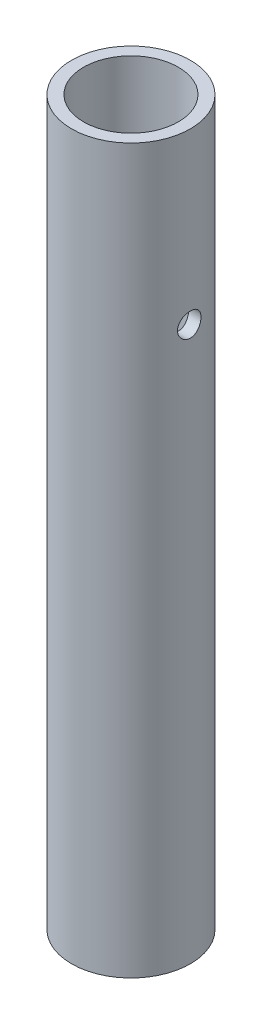
ISO-10303-21;
HEADER;
FILE_DESCRIPTION(('STEP AP214'),'2;1');
FILE_NAME('part.step','',(''),(''),'','','');
FILE_SCHEMA(('AUTOMOTIVE_DESIGN { 1 0 10303 214 1 1 1 1 }'));
ENDSEC;
DATA;
#1=APPLICATION_CONTEXT('core data for automotive mechanical design processes');
#2=APPLICATION_PROTOCOL_DEFINITION('international standard','automotive_design',2000,#1);
#3=PRODUCT_CONTEXT('',#1,'mechanical');
#4=PRODUCT('Part','Part','',(#3));
#5=PRODUCT_RELATED_PRODUCT_CATEGORY('part','',(#4));
#6=PRODUCT_DEFINITION_FORMATION('','',#4);
#7=PRODUCT_DEFINITION_CONTEXT('part definition',#1,'design');
#8=PRODUCT_DEFINITION('design','',#6,#7);
#9=PRODUCT_DEFINITION_SHAPE('','',#8);
#10=(LENGTH_UNIT() NAMED_UNIT(*) SI_UNIT(.MILLI.,.METRE.));
#11=(NAMED_UNIT(*) PLANE_ANGLE_UNIT() SI_UNIT($,.RADIAN.));
#12=(NAMED_UNIT(*) SI_UNIT($,.STERADIAN.) SOLID_ANGLE_UNIT());
#13=UNCERTAINTY_MEASURE_WITH_UNIT(LENGTH_MEASURE(1.E-05),#10,'distance_accuracy_value','');
#14=(GEOMETRIC_REPRESENTATION_CONTEXT(3) GLOBAL_UNCERTAINTY_ASSIGNED_CONTEXT((#13)) GLOBAL_UNIT_ASSIGNED_CONTEXT((#10,
#11,#12)) REPRESENTATION_CONTEXT('',''));
#15=CARTESIAN_POINT('',(0.,0.,0.));
#16=DIRECTION('',(0.,0.,1.));
#17=DIRECTION('',(1.,0.,0.));
#18=AXIS2_PLACEMENT_3D('',#15,#16,#17);
#19=CARTESIAN_POINT('',(0.,0.,0.));
#20=DIRECTION('',(0.,1.,0.));
#21=DIRECTION('',(0.,0.,1.));
#22=AXIS2_PLACEMENT_3D('',#19,#20,#21);
#23=CYLINDRICAL_SURFACE('',#22,13.3223);
#24=CARTESIAN_POINT('',(0.,0.,0.));
#25=DIRECTION('',(0.,1.,0.));
#26=DIRECTION('',(0.,0.,1.));
#27=AXIS2_PLACEMENT_3D('',#24,#25,#26);
#28=CIRCLE('',#27,13.3223);
#29=CARTESIAN_POINT('',(0.,0.,13.3223));
#30=VERTEX_POINT('',#29);
#31=EDGE_CURVE('E18',#30,#30,#28,.F.);
#32=ORIENTED_EDGE('',*,*,#31,.T.);
#33=EDGE_LOOP('',(#32));
#34=FACE_BOUND('',#33,.T.);
#35=CARTESIAN_POINT('',(-13.3223,158.877,0.));
#36=CARTESIAN_POINT('',(-13.322294639179,158.876990703144,-0.182278292137636));
#37=CARTESIAN_POINT('',(-13.3185174570635,158.861839940933,-0.364771511197608));
#38=CARTESIAN_POINT('',(-13.3037998164478,158.801675524074,-0.724692862279841));
#39=CARTESIAN_POINT('',(-13.2928458384035,158.756605505841,-0.902110773875813));
#40=CARTESIAN_POINT('',(-13.2649901836235,158.638133165722,-1.24638988341059));
#41=CARTESIAN_POINT('',(-13.2480986241599,158.564779017767,-1.41326847265805));
#42=CARTESIAN_POINT('',(-13.2101729060818,158.391961825576,-1.73229614620457));
#43=CARTESIAN_POINT('',(-13.1891398324484,158.292505617213,-1.88444907274972));
#44=CARTESIAN_POINT('',(-13.1447330984952,158.068153968626,-2.17287190740062));
#45=CARTESIAN_POINT('',(-13.1213236268952,157.942825987697,-2.30879989700624));
#46=CARTESIAN_POINT('',(-13.0750406037963,157.671208703063,-2.55794545095602));
#47=CARTESIAN_POINT('',(-13.0521671417365,157.524915929726,-2.67115924868774));
#48=CARTESIAN_POINT('',(-13.0091897809992,157.212901673192,-2.8732422321325));
#49=CARTESIAN_POINT('',(-12.989131018168,157.046928489022,-2.96173326562622));
#50=CARTESIAN_POINT('',(-12.9545720766334,156.701886063607,-3.1094263374285));
#51=CARTESIAN_POINT('',(-12.9400709827115,156.522818984409,-3.16863319862442));
#52=CARTESIAN_POINT('',(-12.9186344797221,156.160402730069,-3.25492196742559));
#53=CARTESIAN_POINT('',(-12.9115555872131,155.97720751527,-3.28261404517477));
#54=CARTESIAN_POINT('',(-12.905335408525,155.608645135758,-3.30698749589766));
#55=CARTESIAN_POINT('',(-12.9061928641868,155.423278319963,-3.30367378425611));
#56=CARTESIAN_POINT('',(-12.9156194338021,155.06030241623,-3.26661693356992));
#57=CARTESIAN_POINT('',(-12.9240045560123,154.882613689231,-3.23359976794414));
#58=CARTESIAN_POINT('',(-12.9472487069216,154.535378174955,-3.13923035834609));
#59=CARTESIAN_POINT('',(-12.9621082327313,154.36583201398,-3.07787593859198));
#60=CARTESIAN_POINT('',(-12.9967971748086,154.037737548565,-2.92794949713271));
#61=CARTESIAN_POINT('',(-13.016674684843,153.879315810435,-2.83911209776918));
#62=CARTESIAN_POINT('',(-13.059130857394,153.579377984705,-2.63693341920787));
#63=CARTESIAN_POINT('',(-13.0817098034698,153.437863674932,-2.52358956665402));
#64=CARTESIAN_POINT('',(-13.127797739328,153.171606940357,-2.27187016329784));
#65=CARTESIAN_POINT('',(-13.151315122219,153.047441063177,-2.13288562794202));
#66=CARTESIAN_POINT('',(-13.1960731535057,152.824019761812,-1.83572120261107));
#67=CARTESIAN_POINT('',(-13.2173128196933,152.724775059706,-1.67753309376658));
#68=CARTESIAN_POINT('',(-13.2552279427352,152.553809305524,-1.34559362413278));
#69=CARTESIAN_POINT('',(-13.2718843959315,152.482202370183,-1.17178131383039));
#70=CARTESIAN_POINT('',(-13.2985919663907,152.369518442332,-0.814294141284198));
#71=CARTESIAN_POINT('',(-13.3086568420194,152.328377834903,-0.630640693083809));
#72=CARTESIAN_POINT('',(-13.3173330447338,152.293087755479,-0.371233744867894));
#73=CARTESIAN_POINT('',(-13.3191910874553,152.285562087261,-0.297210316673564));
#74=CARTESIAN_POINT('',(-13.3216756608658,152.275516305855,-0.148803201442547));
#75=CARTESIAN_POINT('',(-13.3223021886846,152.272996204334,-0.0744195135666296));
#76=CARTESIAN_POINT('',(-13.322294639179,152.273009296856,0.182278292137629));
#77=CARTESIAN_POINT('',(-13.3185174570635,152.288160059067,0.364771511197598));
#78=CARTESIAN_POINT('',(-13.3037998164478,152.348324475926,0.724692862279835));
#79=CARTESIAN_POINT('',(-13.2928458384035,152.393394494159,0.902110773875812));
#80=CARTESIAN_POINT('',(-13.2649901836235,152.511866834278,1.2463898834106));
#81=CARTESIAN_POINT('',(-13.2480986241599,152.585220982233,1.41326847265805));
#82=CARTESIAN_POINT('',(-13.2101729060818,152.758038174424,1.73229614620457));
#83=CARTESIAN_POINT('',(-13.1891398324484,152.857494382787,1.88444907274973));
#84=CARTESIAN_POINT('',(-13.1447330984952,153.081846031374,2.17287190740063));
#85=CARTESIAN_POINT('',(-13.1213236268952,153.207174012303,2.30879989700625));
#86=CARTESIAN_POINT('',(-13.0750406037963,153.478791296937,2.55794545095602));
#87=CARTESIAN_POINT('',(-13.0521671417365,153.625084070274,2.67115924868775));
#88=CARTESIAN_POINT('',(-13.0091897809992,153.937098326808,2.8732422321325));
#89=CARTESIAN_POINT('',(-12.989131018168,154.103071510978,2.96173326562622));
#90=CARTESIAN_POINT('',(-12.9545720766334,154.448113936393,3.10942633742851));
#91=CARTESIAN_POINT('',(-12.9400709827115,154.627181015591,3.16863319862443));
#92=CARTESIAN_POINT('',(-12.9186344797221,154.989597269931,3.2549219674256));
#93=CARTESIAN_POINT('',(-12.9115555872131,155.17279248473,3.28261404517478));
#94=CARTESIAN_POINT('',(-12.905335408525,155.541354864242,3.30698749589766));
#95=CARTESIAN_POINT('',(-12.9061928641868,155.726721680037,3.30367378425611));
#96=CARTESIAN_POINT('',(-12.9156194338021,156.08969758377,3.26661693356991));
#97=CARTESIAN_POINT('',(-12.9240045560123,156.267386310769,3.23359976794414));
#98=CARTESIAN_POINT('',(-12.9472487069216,156.614621825045,3.13923035834609));
#99=CARTESIAN_POINT('',(-12.9621082327313,156.78416798602,3.07787593859199));
#100=CARTESIAN_POINT('',(-12.9967971748086,157.112262451435,2.92794949713272));
#101=CARTESIAN_POINT('',(-13.016674684843,157.270684189565,2.83911209776919));
#102=CARTESIAN_POINT('',(-13.059130857394,157.570622015295,2.63693341920786));
#103=CARTESIAN_POINT('',(-13.0817098034698,157.712136325068,2.523589566654));
#104=CARTESIAN_POINT('',(-13.127797739328,157.978393059643,2.27187016329782));
#105=CARTESIAN_POINT('',(-13.151315122219,158.102558936823,2.132885627942));
#106=CARTESIAN_POINT('',(-13.1960731535057,158.325980238188,1.83572120261105));
#107=CARTESIAN_POINT('',(-13.2173128196933,158.425224940294,1.67753309376657));
#108=CARTESIAN_POINT('',(-13.2552279427352,158.596190694476,1.34559362413277));
#109=CARTESIAN_POINT('',(-13.2718843959315,158.667797629817,1.17178131383038));
#110=CARTESIAN_POINT('',(-13.2985919663907,158.780481557668,0.814294141284186));
#111=CARTESIAN_POINT('',(-13.3086568420193,158.821622165097,0.630640693083797));
#112=CARTESIAN_POINT('',(-13.3173330447338,158.856912244521,0.371233744867882));
#113=CARTESIAN_POINT('',(-13.3191910874553,158.864437912739,0.297210316673551));
#114=CARTESIAN_POINT('',(-13.3216756608658,158.874483694145,0.148803201442537));
#115=CARTESIAN_POINT('',(-13.3223021886846,158.877003795666,0.0744195135666218));
#116=CARTESIAN_POINT('',(-13.3223,158.877,0.));
#117=B_SPLINE_CURVE_WITH_KNOTS('',3,(#35,#36,#37,#38,#39,#40,#41,#42,#43,#44,#45,#46,#47,#48,
#49,#50,#51,#52,#53,#54,#55,#56,#57,#58,#59,#60,#61,#62,#63,#64,#65,#66,#67,#68,#69,#70,#71,#72,
#73,#74,#75,#76,#77,#78,#79,#80,#81,#82,#83,#84,#85,#86,#87,#88,#89,#90,#91,#92,#93,#94,#95,#96,
#97,#98,#99,#100,#101,#102,#103,#104,#105,#106,#107,#108,#109,#110,#111,#112,#113,#114,#115,
#116),.UNSPECIFIED.,.T.,.F.,(4,2,2,2,2,2,2,2,2,2,2,2,2,2,2,2,2,2,2,2,2,2,2,2,2,2,2,2,2,2,2,2,2,
2,2,2,2,2,2,2,4),(0.,0.546549565674484,1.09413168528475,1.64078524588517,2.18729578594036,
2.74381523245217,3.3004268884367,3.86513664933092,4.42975337569561,4.98324172940151,
5.53664233942606,6.07687425790906,6.61714766320118,7.16281002305566,7.70852970928399,
8.26944080308511,8.83059281123159,9.39403765025782,9.95630265062595,10.1794441862657,
10.4025862419683,10.9491358076428,11.4967179272531,12.0433714878535,12.5898820279087,
13.1464014744205,13.703013130405,14.2677228912992,14.832339617664,15.3858279713699,
15.9392285813944,16.4794604998774,17.0197339051695,17.565396265024,18.1111159512523,
18.6720270450534,19.2331790531999,19.7966238922261,20.3588888925943,20.5820304282341,
20.8051724839366),.UNSPECIFIED.);
#118=CARTESIAN_POINT('',(-13.3223,158.877,0.));
#119=VERTEX_POINT('',#118);
#120=EDGE_CURVE('E56',#119,#119,#117,.T.);
#121=ORIENTED_EDGE('',*,*,#120,.T.);
#122=EDGE_LOOP('',(#121));
#123=FACE_BOUND('',#122,.T.);
#124=CARTESIAN_POINT('',(0.,203.2,0.));
#125=DIRECTION('',(0.,1.,0.));
#126=DIRECTION('',(0.,0.,1.));
#127=AXIS2_PLACEMENT_3D('',#124,#125,#126);
#128=CIRCLE('',#127,13.3223);
#129=CARTESIAN_POINT('',(0.,203.2,13.3223));
#130=VERTEX_POINT('',#129);
#131=EDGE_CURVE('E61',#130,#130,#128,.F.);
#132=ORIENTED_EDGE('',*,*,#131,.F.);
#133=EDGE_LOOP('',(#132));
#134=FACE_BOUND('',#133,.T.);
#135=CARTESIAN_POINT('',(13.3223,152.273,0.));
#136=CARTESIAN_POINT('',(13.322294639179,152.273009296856,-0.182278292137635));
#137=CARTESIAN_POINT('',(13.3185174570635,152.288160059067,-0.364771511197606));
#138=CARTESIAN_POINT('',(13.3037998164478,152.348324475926,-0.724692862279841));
#139=CARTESIAN_POINT('',(13.2928458384035,152.393394494159,-0.902110773875815));
#140=CARTESIAN_POINT('',(13.2649901836235,152.511866834278,-1.2463898834106));
#141=CARTESIAN_POINT('',(13.2480986241599,152.585220982233,-1.41326847265805));
#142=CARTESIAN_POINT('',(13.2101729060818,152.758038174424,-1.73229614620457));
#143=CARTESIAN_POINT('',(13.1891398324484,152.857494382787,-1.88444907274973));
#144=CARTESIAN_POINT('',(13.1447330984952,153.081846031374,-2.17287190740063));
#145=CARTESIAN_POINT('',(13.1213236268952,153.207174012303,-2.30879989700625));
#146=CARTESIAN_POINT('',(13.0750406037963,153.478791296937,-2.55794545095602));
#147=CARTESIAN_POINT('',(13.0521671417365,153.625084070274,-2.67115924868775));
#148=CARTESIAN_POINT('',(13.0091897809992,153.937098326808,-2.8732422321325));
#149=CARTESIAN_POINT('',(12.989131018168,154.103071510978,-2.96173326562622));
#150=CARTESIAN_POINT('',(12.9545720766334,154.448113936393,-3.10942633742851));
#151=CARTESIAN_POINT('',(12.9400709827115,154.627181015591,-3.16863319862443));
#152=CARTESIAN_POINT('',(12.9186344797221,154.989597269931,-3.2549219674256));
#153=CARTESIAN_POINT('',(12.9115555872131,155.17279248473,-3.28261404517478));
#154=CARTESIAN_POINT('',(12.905335408525,155.541354864242,-3.30698749589766));
#155=CARTESIAN_POINT('',(12.9061928641868,155.726721680037,-3.30367378425611));
#156=CARTESIAN_POINT('',(12.9156194338021,156.08969758377,-3.26661693356991));
#157=CARTESIAN_POINT('',(12.9240045560123,156.267386310769,-3.23359976794414));
#158=CARTESIAN_POINT('',(12.9472487069216,156.614621825045,-3.13923035834609));
#159=CARTESIAN_POINT('',(12.9621082327313,156.78416798602,-3.07787593859199));
#160=CARTESIAN_POINT('',(12.9967971748086,157.112262451435,-2.92794949713272));
#161=CARTESIAN_POINT('',(13.016674684843,157.270684189565,-2.83911209776919));
#162=CARTESIAN_POINT('',(13.059130857394,157.570622015295,-2.63693341920786));
#163=CARTESIAN_POINT('',(13.0817098034698,157.712136325068,-2.523589566654));
#164=CARTESIAN_POINT('',(13.127797739328,157.978393059643,-2.27187016329781));
#165=CARTESIAN_POINT('',(13.151315122219,158.102558936823,-2.13288562794198));
#166=CARTESIAN_POINT('',(13.1960731535057,158.325980238188,-1.83572120261104));
#167=CARTESIAN_POINT('',(13.2173128196933,158.425224940294,-1.67753309376656));
#168=CARTESIAN_POINT('',(13.2552279427352,158.596190694476,-1.34559362413277));
#169=CARTESIAN_POINT('',(13.2718843959315,158.667797629817,-1.17178131383038));
#170=CARTESIAN_POINT('',(13.2985919663907,158.780481557668,-0.814294141284186));
#171=CARTESIAN_POINT('',(13.3086568420193,158.821622165097,-0.630640693083797));
#172=CARTESIAN_POINT('',(13.3173330447338,158.856912244521,-0.371233744867883));
#173=CARTESIAN_POINT('',(13.3191910874553,158.864437912739,-0.297210316673552));
#174=CARTESIAN_POINT('',(13.3216756608658,158.874483694145,-0.148803201442539));
#175=CARTESIAN_POINT('',(13.3223021886846,158.877003795666,-0.0744195135666243));
#176=CARTESIAN_POINT('',(13.322294639179,158.876990703144,0.18227829213763));
#177=CARTESIAN_POINT('',(13.3185174570635,158.861839940933,0.364771511197599));
#178=CARTESIAN_POINT('',(13.3037998164478,158.801675524074,0.724692862279833));
#179=CARTESIAN_POINT('',(13.2928458384035,158.756605505841,0.902110773875808));
#180=CARTESIAN_POINT('',(13.2649901836235,158.638133165722,1.24638988341059));
#181=CARTESIAN_POINT('',(13.2480986241599,158.564779017767,1.41326847265805));
#182=CARTESIAN_POINT('',(13.2101729060818,158.391961825576,1.73229614620457));
#183=CARTESIAN_POINT('',(13.1891398324484,158.292505617213,1.88444907274972));
#184=CARTESIAN_POINT('',(13.1447330984952,158.068153968626,2.17287190740062));
#185=CARTESIAN_POINT('',(13.1213236268952,157.942825987697,2.30879989700624));
#186=CARTESIAN_POINT('',(13.0750406037963,157.671208703063,2.55794545095602));
#187=CARTESIAN_POINT('',(13.0521671417365,157.524915929726,2.67115924868774));
#188=CARTESIAN_POINT('',(13.0091897809992,157.212901673192,2.8732422321325));
#189=CARTESIAN_POINT('',(12.989131018168,157.046928489022,2.96173326562622));
#190=CARTESIAN_POINT('',(12.9545720766334,156.701886063607,3.1094263374285));
#191=CARTESIAN_POINT('',(12.9400709827115,156.522818984409,3.16863319862442));
#192=CARTESIAN_POINT('',(12.9186344797221,156.160402730069,3.25492196742559));
#193=CARTESIAN_POINT('',(12.9115555872131,155.97720751527,3.28261404517477));
#194=CARTESIAN_POINT('',(12.905335408525,155.608645135758,3.30698749589766));
#195=CARTESIAN_POINT('',(12.9061928641868,155.423278319963,3.30367378425611));
#196=CARTESIAN_POINT('',(12.9156194338021,155.06030241623,3.26661693356991));
#197=CARTESIAN_POINT('',(12.9240045560123,154.882613689231,3.23359976794413));
#198=CARTESIAN_POINT('',(12.9472487069216,154.535378174955,3.13923035834607));
#199=CARTESIAN_POINT('',(12.9621082327313,154.36583201398,3.07787593859197));
#200=CARTESIAN_POINT('',(12.9967971748086,154.037737548565,2.92794949713271));
#201=CARTESIAN_POINT('',(13.016674684843,153.879315810435,2.83911209776918));
#202=CARTESIAN_POINT('',(13.059130857394,153.579377984705,2.63693341920787));
#203=CARTESIAN_POINT('',(13.0817098034698,153.437863674932,2.52358956665402));
#204=CARTESIAN_POINT('',(13.127797739328,153.171606940357,2.27187016329784));
#205=CARTESIAN_POINT('',(13.151315122219,153.047441063177,2.13288562794202));
#206=CARTESIAN_POINT('',(13.1960731535057,152.824019761812,1.83572120261107));
#207=CARTESIAN_POINT('',(13.2173128196933,152.724775059706,1.67753309376658));
#208=CARTESIAN_POINT('',(13.2552279427352,152.553809305524,1.34559362413278));
#209=CARTESIAN_POINT('',(13.2718843959315,152.482202370183,1.17178131383039));
#210=CARTESIAN_POINT('',(13.2985919663907,152.369518442332,0.814294141284198));
#211=CARTESIAN_POINT('',(13.3086568420194,152.328377834903,0.630640693083809));
#212=CARTESIAN_POINT('',(13.3173330447338,152.293087755479,0.371233744867893));
#213=CARTESIAN_POINT('',(13.3191910874553,152.285562087261,0.297210316673561));
#214=CARTESIAN_POINT('',(13.3216756608658,152.275516305855,0.148803201442543));
#215=CARTESIAN_POINT('',(13.3223021886846,152.272996204334,0.0744195135666254));
#216=CARTESIAN_POINT('',(13.3223,152.273,0.));
#217=B_SPLINE_CURVE_WITH_KNOTS('',3,(#135,#136,#137,#138,#139,#140,#141,#142,#143,#144,#145,
#146,#147,#148,#149,#150,#151,#152,#153,#154,#155,#156,#157,#158,#159,#160,#161,#162,#163,#164,
#165,#166,#167,#168,#169,#170,#171,#172,#173,#174,#175,#176,#177,#178,#179,#180,#181,#182,#183,
#184,#185,#186,#187,#188,#189,#190,#191,#192,#193,#194,#195,#196,#197,#198,#199,#200,#201,#202,
#203,#204,#205,#206,#207,#208,#209,#210,#211,#212,#213,#214,#215,#216),.UNSPECIFIED.,.T.,.F.,(4,
2,2,2,2,2,2,2,2,2,2,2,2,2,2,2,2,2,2,2,2,2,2,2,2,2,2,2,2,2,2,2,2,2,2,2,2,2,2,2,4),(0.,
0.546549565674482,1.09413168528476,1.64078524588517,2.18729578594036,2.74381523245217,
3.3004268884367,3.86513664933092,4.42975337569565,4.98324172940154,5.5366423394261,
6.07687425790907,6.61714766320115,7.16281002305567,7.70852970928403,8.26944080308517,
8.8305928112316,9.39403765025783,9.95630265062596,10.1794441862657,10.4025862419683,
10.9491358076428,11.4967179272531,12.0433714878535,12.5898820279087,13.1464014744205,
13.703013130405,14.2677228912992,14.8323396176639,15.3858279713698,15.9392285813944,
16.4794604998775,17.0197339051695,17.565396265024,18.1111159512523,18.6720270450534,
19.2331790531999,19.7966238922261,20.3588888925943,20.582030428234,20.8051724839366),.UNSPECIFIED.);
#218=CARTESIAN_POINT('',(13.3223,152.273,0.));
#219=VERTEX_POINT('',#218);
#220=EDGE_CURVE('E63',#219,#219,#217,.T.);
#221=ORIENTED_EDGE('',*,*,#220,.T.);
#222=EDGE_LOOP('',(#221));
#223=FACE_BOUND('',#222,.T.);
#224=ADVANCED_FACE('F14',(#34,#123,#134,#223),#23,.F.);
#225=CARTESIAN_POINT('',(0.,0.,0.));
#226=DIRECTION('',(0.,1.,0.));
#227=DIRECTION('',(0.,0.,1.));
#228=AXIS2_PLACEMENT_3D('',#225,#226,#227);
#229=PLANE('',#228);
#230=ORIENTED_EDGE('',*,*,#31,.F.);
#231=EDGE_LOOP('',(#230));
#232=FACE_BOUND('',#231,.T.);
#233=CARTESIAN_POINT('',(0.,0.,0.));
#234=DIRECTION('',(0.,1.,0.));
#235=DIRECTION('',(0.,0.,1.));
#236=AXIS2_PLACEMENT_3D('',#233,#234,#235);
#237=CIRCLE('',#236,16.7005);
#238=CARTESIAN_POINT('',(0.,0.,16.7005));
#239=VERTEX_POINT('',#238);
#240=EDGE_CURVE('E47',#239,#239,#237,.T.);
#241=ORIENTED_EDGE('',*,*,#240,.F.);
#242=EDGE_LOOP('',(#241));
#243=FACE_BOUND('',#242,.T.);
#244=ADVANCED_FACE('F53',(#232,#243),#229,.F.);
#245=CARTESIAN_POINT('',(20.0406,155.575,0.));
#246=DIRECTION('',(-1.,0.,0.));
#247=DIRECTION('',(0.,0.,1.));
#248=AXIS2_PLACEMENT_3D('',#245,#246,#247);
#249=CYLINDRICAL_SURFACE('',#248,3.302);
#250=ORIENTED_EDGE('',*,*,#120,.F.);
#251=EDGE_LOOP('',(#250));
#252=FACE_BOUND('',#251,.T.);
#253=CARTESIAN_POINT('',(-16.7005,152.273,0.));
#254=CARTESIAN_POINT('',(-16.7004957926447,152.273008770955,-0.183368302989549));
#255=CARTESIAN_POINT('',(-16.6974460585411,152.288340042931,-0.36696466367579));
#256=CARTESIAN_POINT('',(-16.6855646749529,152.349254834118,-0.72911739186718));
#257=CARTESIAN_POINT('',(-16.6767215613497,152.394898338571,-0.907663032541528));
#258=CARTESIAN_POINT('',(-16.6542417841035,152.514978858828,-1.25420734498297));
#259=CARTESIAN_POINT('',(-16.6406118477063,152.589375480598,-1.42222043035347));
#260=CARTESIAN_POINT('',(-16.6100449592769,152.764747267748,-1.74331631363568));
#261=CARTESIAN_POINT('',(-16.5931091121348,152.86571355702,-1.8964040742759));
#262=CARTESIAN_POINT('',(-16.5575397257524,153.09279972247,-2.18541982285051));
#263=CARTESIAN_POINT('',(-16.5388882784448,153.219206454156,-2.32112025975612));
#264=CARTESIAN_POINT('',(-16.5021199274408,153.49297446154,-2.56954204470264));
#265=CARTESIAN_POINT('',(-16.4840030934909,153.64033845688,-2.68226040571118));
#266=CARTESIAN_POINT('',(-16.4501835873996,153.953446076531,-2.88246331821048));
#267=CARTESIAN_POINT('',(-16.4345037026551,154.11934083657,-2.96971569114902));
#268=CARTESIAN_POINT('',(-16.4075847491338,154.463795544569,-3.11502153933343));
#269=CARTESIAN_POINT('',(-16.3963452145875,154.642354161838,-3.17307807724409));
#270=CARTESIAN_POINT('',(-16.3797587025318,155.004645861586,-3.25761495240447));
#271=CARTESIAN_POINT('',(-16.3743380519711,155.188283299662,-3.28449043517295));
#272=CARTESIAN_POINT('',(-16.3697812375393,155.557534904104,-3.30712947778651));
#273=CARTESIAN_POINT('',(-16.3706444556172,155.743148874275,-3.3028960973483));
#274=CARTESIAN_POINT('',(-16.3784908689964,156.108197045883,-3.26375732030322));
#275=CARTESIAN_POINT('',(-16.3853837618015,156.287681998395,-3.22930448034309));
#276=CARTESIAN_POINT('',(-16.4043708305652,156.638274414373,-3.13141834182693));
#277=CARTESIAN_POINT('',(-16.4164652896277,156.809381421291,-3.06798346586383));
#278=CARTESIAN_POINT('',(-16.4445859031723,157.139672374428,-2.91349756776403));
#279=CARTESIAN_POINT('',(-16.4606376707703,157.298769457272,-2.82226568796545));
#280=CARTESIAN_POINT('',(-16.4948462105759,157.599554544122,-2.61491034201697));
#281=CARTESIAN_POINT('',(-16.5130030640963,157.741241875209,-2.49878591419968));
#282=CARTESIAN_POINT('',(-16.5497652848046,158.005786748191,-2.24253814872142));
#283=CARTESIAN_POINT('',(-16.5683729606496,158.12827397345,-2.10203257179186));
#284=CARTESIAN_POINT('',(-16.6036594630105,158.348052166667,-1.80220433787292));
#285=CARTESIAN_POINT('',(-16.6203374394586,158.445332053543,-1.64287344998344));
#286=CARTESIAN_POINT('',(-16.6499268180049,158.611993814081,-1.309467547124));
#287=CARTESIAN_POINT('',(-16.6628295398498,158.681311532053,-1.13535972277991));
#288=CARTESIAN_POINT('',(-16.6833292724906,158.789473412118,-0.77788205791135));
#289=CARTESIAN_POINT('',(-16.6909374210054,158.828381565451,-0.594532535600926));
#290=CARTESIAN_POINT('',(-16.6971478197678,158.860009682992,-0.341493906958734));
#291=CARTESIAN_POINT('',(-16.6984020788911,158.866375606728,-0.273365991542344));
#292=CARTESIAN_POINT('',(-16.7000789546659,158.874872404747,-0.136835972406552));
#293=CARTESIAN_POINT('',(-16.7005015702038,158.877003273359,-0.0684338683200994));
#294=CARTESIAN_POINT('',(-16.7004957926447,158.876991229045,0.183368302989546));
#295=CARTESIAN_POINT('',(-16.6974460585411,158.861659957069,0.366964663675788));
#296=CARTESIAN_POINT('',(-16.6855646749529,158.800745165882,0.729117391867182));
#297=CARTESIAN_POINT('',(-16.6767215613497,158.755101661429,0.90766303254153));
#298=CARTESIAN_POINT('',(-16.6542417841035,158.635021141172,1.25420734498298));
#299=CARTESIAN_POINT('',(-16.6406118477063,158.560624519402,1.42222043035348));
#300=CARTESIAN_POINT('',(-16.6100449592769,158.385252732252,1.7433163136357));
#301=CARTESIAN_POINT('',(-16.5931091121348,158.28428644298,1.89640407427592));
#302=CARTESIAN_POINT('',(-16.5575397257524,158.05720027753,2.18541982285053));
#303=CARTESIAN_POINT('',(-16.5388882784448,157.930793545844,2.32112025975613));
#304=CARTESIAN_POINT('',(-16.5021199274408,157.65702553846,2.56954204470264));
#305=CARTESIAN_POINT('',(-16.4840030934909,157.50966154312,2.68226040571119));
#306=CARTESIAN_POINT('',(-16.4501835873996,157.196553923469,2.88246331821049));
#307=CARTESIAN_POINT('',(-16.4345037026551,157.03065916343,2.96971569114902));
#308=CARTESIAN_POINT('',(-16.4075847491338,156.686204455431,3.11502153933343));
#309=CARTESIAN_POINT('',(-16.3963452145875,156.507645838162,3.1730780772441));
#310=CARTESIAN_POINT('',(-16.3797587025318,156.145354138414,3.25761495240448));
#311=CARTESIAN_POINT('',(-16.3743380519711,155.961716700338,3.28449043517295));
#312=CARTESIAN_POINT('',(-16.3697812375393,155.592465095896,3.30712947778651));
#313=CARTESIAN_POINT('',(-16.3706444556172,155.406851125725,3.3028960973483));
#314=CARTESIAN_POINT('',(-16.3784908689964,155.041802954116,3.26375732030322));
#315=CARTESIAN_POINT('',(-16.3853837618015,154.862318001605,3.22930448034309));
#316=CARTESIAN_POINT('',(-16.4043708305652,154.511725585627,3.13141834182693));
#317=CARTESIAN_POINT('',(-16.4164652896277,154.340618578709,3.06798346586383));
#318=CARTESIAN_POINT('',(-16.4445859031723,154.010327625572,2.91349756776403));
#319=CARTESIAN_POINT('',(-16.4606376707703,153.851230542728,2.82226568796546));
#320=CARTESIAN_POINT('',(-16.4948462105759,153.550445455878,2.61491034201699));
#321=CARTESIAN_POINT('',(-16.5130030640963,153.408758124791,2.49878591419969));
#322=CARTESIAN_POINT('',(-16.5497652848046,153.144213251809,2.24253814872142));
#323=CARTESIAN_POINT('',(-16.5683729606496,153.02172602655,2.10203257179186));
#324=CARTESIAN_POINT('',(-16.6036594630105,152.801947833333,1.80220433787292));
#325=CARTESIAN_POINT('',(-16.6203374394586,152.704667946457,1.64287344998344));
#326=CARTESIAN_POINT('',(-16.6499268180049,152.538006185919,1.30946754712399));
#327=CARTESIAN_POINT('',(-16.6628295398498,152.468688467947,1.1353597227799));
#328=CARTESIAN_POINT('',(-16.6833292724906,152.360526587882,0.777882057911345));
#329=CARTESIAN_POINT('',(-16.6909374210054,152.321618434549,0.594532535600919));
#330=CARTESIAN_POINT('',(-16.6971478197678,152.289990317008,0.341493906958726));
#331=CARTESIAN_POINT('',(-16.6984020788911,152.283624393272,0.273365991542337));
#332=CARTESIAN_POINT('',(-16.7000789546659,152.275127595253,0.136835972406546));
#333=CARTESIAN_POINT('',(-16.7005015702038,152.272996726641,0.0684338683200942));
#334=CARTESIAN_POINT('',(-16.7005,152.273,0.));
#335=B_SPLINE_CURVE_WITH_KNOTS('',3,(#253,#254,#255,#256,#257,#258,#259,#260,#261,#262,#263,
#264,#265,#266,#267,#268,#269,#270,#271,#272,#273,#274,#275,#276,#277,#278,#279,#280,#281,#282,
#283,#284,#285,#286,#287,#288,#289,#290,#291,#292,#293,#294,#295,#296,#297,#298,#299,#300,#301,
#302,#303,#304,#305,#306,#307,#308,#309,#310,#311,#312,#313,#314,#315,#316,#317,#318,#319,#320,
#321,#322,#323,#324,#325,#326,#327,#328,#329,#330,#331,#332,#333,#334),.UNSPECIFIED.,.T.,.F.,(4,
2,2,2,2,2,2,2,2,2,2,2,2,2,2,2,2,2,2,2,2,2,2,2,2,2,2,2,2,2,2,2,2,2,2,2,2,2,2,2,4),(0.,
0.549843308791086,1.10077796441786,1.65094143236226,2.20092134042981,2.75749015923788,
3.31413127050489,3.87569928839962,4.43720838509709,4.99152116797832,5.5457794320758,
6.09187636375715,6.63800302143142,7.18776173834906,7.73754169778235,8.2968827620086,
8.85646929558587,9.41733252600156,9.97701232296897,10.1822160227836,10.3874199973911,
10.9372633061822,11.488197961809,12.0383614297534,12.5883413378209,13.144910156629,
13.701551267896,14.2631192857907,14.8246283824882,15.3789411653694,15.9331994294669,
16.4792963611483,17.0254230188225,17.5751817357401,18.1249616951735,18.6843027593997,
19.243889292977,19.8047525233927,20.3644323203601,20.5696360201747,20.7748399947822),.UNSPECIFIED.);
#336=CARTESIAN_POINT('',(-16.7005,152.273,0.));
#337=VERTEX_POINT('',#336);
#338=EDGE_CURVE('E27',#337,#337,#335,.T.);
#339=ORIENTED_EDGE('',*,*,#338,.F.);
#340=EDGE_LOOP('',(#339));
#341=FACE_BOUND('',#340,.T.);
#342=ADVANCED_FACE('F49',(#252,#341),#249,.F.);
#343=CARTESIAN_POINT('',(0.,203.2,0.));
#344=DIRECTION('',(0.,1.,0.));
#345=DIRECTION('',(0.,0.,1.));
#346=AXIS2_PLACEMENT_3D('',#343,#344,#345);
#347=PLANE('',#346);
#348=ORIENTED_EDGE('',*,*,#131,.T.);
#349=EDGE_LOOP('',(#348));
#350=FACE_BOUND('',#349,.T.);
#351=CARTESIAN_POINT('',(0.,203.2,0.));
#352=DIRECTION('',(0.,1.,0.));
#353=DIRECTION('',(0.,0.,1.));
#354=AXIS2_PLACEMENT_3D('',#351,#352,#353);
#355=CIRCLE('',#354,16.7005);
#356=CARTESIAN_POINT('',(0.,203.2,16.7005));
#357=VERTEX_POINT('',#356);
#358=EDGE_CURVE('E22',#357,#357,#355,.F.);
#359=ORIENTED_EDGE('',*,*,#358,.F.);
#360=EDGE_LOOP('',(#359));
#361=FACE_BOUND('',#360,.T.);
#362=ADVANCED_FACE('F52',(#350,#361),#347,.T.);
#363=CARTESIAN_POINT('',(20.0406,155.575,0.));
#364=DIRECTION('',(-1.,0.,0.));
#365=DIRECTION('',(0.,0.,1.));
#366=AXIS2_PLACEMENT_3D('',#363,#364,#365);
#367=CYLINDRICAL_SURFACE('',#366,3.302);
#368=ORIENTED_EDGE('',*,*,#220,.F.);
#369=EDGE_LOOP('',(#368));
#370=FACE_BOUND('',#369,.T.);
#371=CARTESIAN_POINT('',(16.7005,158.877,0.));
#372=CARTESIAN_POINT('',(16.7004957926447,158.876991229045,-0.183368302989547));
#373=CARTESIAN_POINT('',(16.6974460585411,158.861659957069,-0.366964663675789));
#374=CARTESIAN_POINT('',(16.6855646749529,158.800745165882,-0.729117391867182));
#375=CARTESIAN_POINT('',(16.6767215613497,158.755101661429,-0.907663032541531));
#376=CARTESIAN_POINT('',(16.6542417841035,158.635021141172,-1.25420734498298));
#377=CARTESIAN_POINT('',(16.6406118477063,158.560624519402,-1.42222043035348));
#378=CARTESIAN_POINT('',(16.6100449592769,158.385252732252,-1.7433163136357));
#379=CARTESIAN_POINT('',(16.5931091121348,158.28428644298,-1.89640407427592));
#380=CARTESIAN_POINT('',(16.5575397257524,158.05720027753,-2.18541982285053));
#381=CARTESIAN_POINT('',(16.5388882784448,157.930793545844,-2.32112025975613));
#382=CARTESIAN_POINT('',(16.5021199274408,157.65702553846,-2.56954204470264));
#383=CARTESIAN_POINT('',(16.4840030934909,157.50966154312,-2.68226040571118));
#384=CARTESIAN_POINT('',(16.4501835873996,157.196553923469,-2.88246331821048));
#385=CARTESIAN_POINT('',(16.4345037026551,157.03065916343,-2.96971569114902));
#386=CARTESIAN_POINT('',(16.4075847491338,156.686204455431,-3.11502153933343));
#387=CARTESIAN_POINT('',(16.3963452145875,156.507645838162,-3.1730780772441));
#388=CARTESIAN_POINT('',(16.3797587025318,156.145354138414,-3.25761495240448));
#389=CARTESIAN_POINT('',(16.3743380519711,155.961716700338,-3.28449043517295));
#390=CARTESIAN_POINT('',(16.3697812375393,155.592465095896,-3.30712947778651));
#391=CARTESIAN_POINT('',(16.3706444556172,155.406851125725,-3.3028960973483));
#392=CARTESIAN_POINT('',(16.3784908689964,155.041802954116,-3.26375732030322));
#393=CARTESIAN_POINT('',(16.3853837618015,154.862318001605,-3.22930448034309));
#394=CARTESIAN_POINT('',(16.4043708305652,154.511725585627,-3.13141834182693));
#395=CARTESIAN_POINT('',(16.4164652896277,154.340618578709,-3.06798346586383));
#396=CARTESIAN_POINT('',(16.4445859031723,154.010327625572,-2.91349756776403));
#397=CARTESIAN_POINT('',(16.4606376707703,153.851230542728,-2.82226568796546));
#398=CARTESIAN_POINT('',(16.4948462105759,153.550445455878,-2.61491034201699));
#399=CARTESIAN_POINT('',(16.5130030640963,153.408758124791,-2.49878591419969));
#400=CARTESIAN_POINT('',(16.5497652848046,153.144213251809,-2.24253814872142));
#401=CARTESIAN_POINT('',(16.5683729606496,153.02172602655,-2.10203257179186));
#402=CARTESIAN_POINT('',(16.6036594630105,152.801947833333,-1.80220433787291));
#403=CARTESIAN_POINT('',(16.6203374394586,152.704667946457,-1.64287344998343));
#404=CARTESIAN_POINT('',(16.6499268180049,152.538006185919,-1.30946754712399));
#405=CARTESIAN_POINT('',(16.6628295398498,152.468688467947,-1.1353597227799));
#406=CARTESIAN_POINT('',(16.6833292724906,152.360526587882,-0.77788205791134));
#407=CARTESIAN_POINT('',(16.6909374210054,152.321618434549,-0.594532535600915));
#408=CARTESIAN_POINT('',(16.6971478197678,152.289990317008,-0.341493906958724));
#409=CARTESIAN_POINT('',(16.6984020788911,152.283624393272,-0.273365991542335));
#410=CARTESIAN_POINT('',(16.7000789546659,152.275127595253,-0.136835972406545));
#411=CARTESIAN_POINT('',(16.7005015702038,152.272996726641,-0.068433868320095));
#412=CARTESIAN_POINT('',(16.7004957926447,152.273008770955,0.183368302989546));
#413=CARTESIAN_POINT('',(16.6974460585411,152.288340042931,0.366964663675787));
#414=CARTESIAN_POINT('',(16.6855646749529,152.349254834118,0.729117391867178));
#415=CARTESIAN_POINT('',(16.6767215613497,152.394898338571,0.907663032541526));
#416=CARTESIAN_POINT('',(16.6542417841035,152.514978858828,1.25420734498297));
#417=CARTESIAN_POINT('',(16.6406118477063,152.589375480598,1.42222043035347));
#418=CARTESIAN_POINT('',(16.6100449592769,152.764747267748,1.74331631363568));
#419=CARTESIAN_POINT('',(16.5931091121348,152.86571355702,1.89640407427591));
#420=CARTESIAN_POINT('',(16.5575397257524,153.09279972247,2.18541982285051));
#421=CARTESIAN_POINT('',(16.5388882784448,153.219206454156,2.32112025975611));
#422=CARTESIAN_POINT('',(16.5021199274408,153.49297446154,2.56954204470262));
#423=CARTESIAN_POINT('',(16.4840030934909,153.64033845688,2.68226040571118));
#424=CARTESIAN_POINT('',(16.4501835873996,153.953446076531,2.88246331821048));
#425=CARTESIAN_POINT('',(16.4345037026551,154.11934083657,2.96971569114902));
#426=CARTESIAN_POINT('',(16.4075847491338,154.463795544569,3.11502153933342));
#427=CARTESIAN_POINT('',(16.3963452145875,154.642354161838,3.17307807724409));
#428=CARTESIAN_POINT('',(16.3797587025318,155.004645861586,3.25761495240447));
#429=CARTESIAN_POINT('',(16.3743380519711,155.188283299662,3.28449043517295));
#430=CARTESIAN_POINT('',(16.3697812375393,155.557534904104,3.30712947778651));
#431=CARTESIAN_POINT('',(16.3706444556172,155.743148874275,3.3028960973483));
#432=CARTESIAN_POINT('',(16.3784908689964,156.108197045883,3.26375732030322));
#433=CARTESIAN_POINT('',(16.3853837618015,156.287681998395,3.22930448034309));
#434=CARTESIAN_POINT('',(16.4043708305652,156.638274414373,3.13141834182693));
#435=CARTESIAN_POINT('',(16.4164652896277,156.809381421291,3.06798346586384));
#436=CARTESIAN_POINT('',(16.4445859031723,157.139672374428,2.91349756776403));
#437=CARTESIAN_POINT('',(16.4606376707703,157.298769457272,2.82226568796546));
#438=CARTESIAN_POINT('',(16.4948462105759,157.599554544122,2.61491034201699));
#439=CARTESIAN_POINT('',(16.5130030640963,157.741241875209,2.49878591419969));
#440=CARTESIAN_POINT('',(16.5497652848046,158.005786748191,2.24253814872143));
#441=CARTESIAN_POINT('',(16.5683729606496,158.12827397345,2.10203257179187));
#442=CARTESIAN_POINT('',(16.6036594630105,158.348052166667,1.80220433787293));
#443=CARTESIAN_POINT('',(16.6203374394586,158.445332053543,1.64287344998344));
#444=CARTESIAN_POINT('',(16.6499268180049,158.611993814081,1.309467547124));
#445=CARTESIAN_POINT('',(16.6628295398498,158.681311532053,1.13535972277991));
#446=CARTESIAN_POINT('',(16.6833292724906,158.789473412118,0.777882057911352));
#447=CARTESIAN_POINT('',(16.6909374210054,158.828381565451,0.594532535600928));
#448=CARTESIAN_POINT('',(16.6971478197678,158.860009682992,0.341493906958734));
#449=CARTESIAN_POINT('',(16.6984020788911,158.866375606728,0.273365991542344));
#450=CARTESIAN_POINT('',(16.7000789546659,158.874872404747,0.136835972406551));
#451=CARTESIAN_POINT('',(16.7005015702038,158.877003273359,0.0684338683200978));
#452=CARTESIAN_POINT('',(16.7005,158.877,0.));
#453=B_SPLINE_CURVE_WITH_KNOTS('',3,(#371,#372,#373,#374,#375,#376,#377,#378,#379,#380,#381,
#382,#383,#384,#385,#386,#387,#388,#389,#390,#391,#392,#393,#394,#395,#396,#397,#398,#399,#400,
#401,#402,#403,#404,#405,#406,#407,#408,#409,#410,#411,#412,#413,#414,#415,#416,#417,#418,#419,
#420,#421,#422,#423,#424,#425,#426,#427,#428,#429,#430,#431,#432,#433,#434,#435,#436,#437,#438,
#439,#440,#441,#442,#443,#444,#445,#446,#447,#448,#449,#450,#451,#452),.UNSPECIFIED.,.T.,.F.,(4,
2,2,2,2,2,2,2,2,2,2,2,2,2,2,2,2,2,2,2,2,2,2,2,2,2,2,2,2,2,2,2,2,2,2,2,2,2,2,2,4),(0.,
0.549843308791089,1.10077796441787,1.65094143236228,2.20092134042983,2.75749015923789,
3.3141312705049,3.87569928839963,4.43720838509712,4.99152116797833,5.5457794320758,
6.09187636375716,6.63800302143142,7.18776173834901,7.73754169778236,8.29688276200861,
8.85646929558588,9.41733252600158,9.97701232296898,10.1822160227836,10.3874199973911,
10.9372633061822,11.488197961809,12.0383614297534,12.5883413378209,13.144910156629,
13.701551267896,14.2631192857907,14.8246283824882,15.3789411653694,15.9331994294669,
16.4792963611482,17.0254230188225,17.5751817357401,18.1249616951735,18.6843027593997,
19.243889292977,19.8047525233927,20.3644323203601,20.5696360201747,20.7748399947822),.UNSPECIFIED.);
#454=CARTESIAN_POINT('',(16.7005,158.877,0.));
#455=VERTEX_POINT('',#454);
#456=EDGE_CURVE('E10',#455,#455,#453,.T.);
#457=ORIENTED_EDGE('',*,*,#456,.F.);
#458=EDGE_LOOP('',(#457));
#459=FACE_BOUND('',#458,.T.);
#460=ADVANCED_FACE('F34',(#370,#459),#367,.F.);
#461=CARTESIAN_POINT('',(0.,0.,0.));
#462=DIRECTION('',(0.,1.,0.));
#463=DIRECTION('',(0.,0.,1.));
#464=AXIS2_PLACEMENT_3D('',#461,#462,#463);
#465=CYLINDRICAL_SURFACE('',#464,16.7005);
#466=ORIENTED_EDGE('',*,*,#240,.T.);
#467=EDGE_LOOP('',(#466));
#468=FACE_BOUND('',#467,.T.);
#469=ORIENTED_EDGE('',*,*,#338,.T.);
#470=EDGE_LOOP('',(#469));
#471=FACE_BOUND('',#470,.T.);
#472=ORIENTED_EDGE('',*,*,#358,.T.);
#473=EDGE_LOOP('',(#472));
#474=FACE_BOUND('',#473,.T.);
#475=ORIENTED_EDGE('',*,*,#456,.T.);
#476=EDGE_LOOP('',(#475));
#477=FACE_BOUND('',#476,.T.);
#478=ADVANCED_FACE('F37',(#468,#471,#474,#477),#465,.T.);
#479=CLOSED_SHELL('',(#224,#244,#342,#362,#460,#478));
#480=MANIFOLD_SOLID_BREP('B1',#479);
#481=ADVANCED_BREP_SHAPE_REPRESENTATION('',(#18,#480),#14);
#482=SHAPE_DEFINITION_REPRESENTATION(#9,#481);
ENDSEC;
END-ISO-10303-21;
